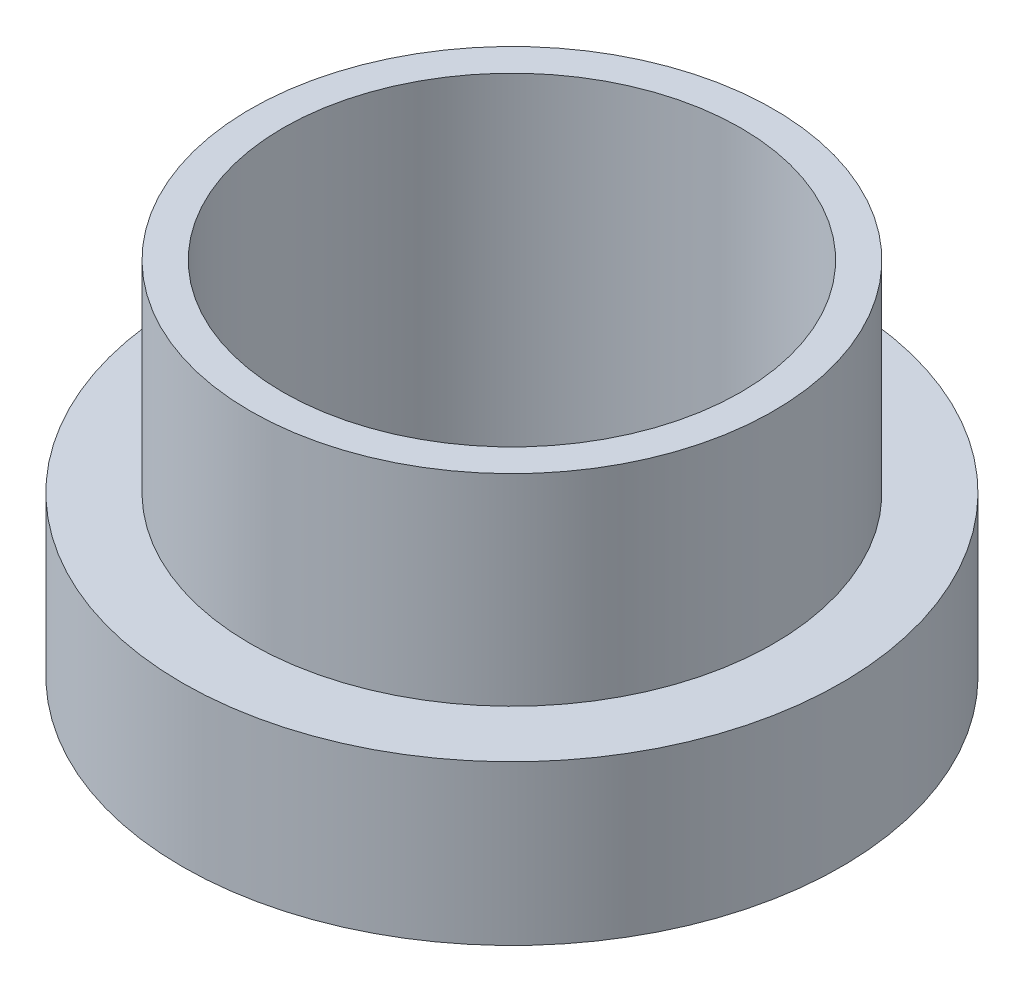
ISO-10303-21;
HEADER;
FILE_DESCRIPTION(('STEP AP214'),'2;1');
FILE_NAME('part.step','',(''),(''),'','','');
FILE_SCHEMA(('AUTOMOTIVE_DESIGN { 1 0 10303 214 1 1 1 1 }'));
ENDSEC;
DATA;
#1=APPLICATION_CONTEXT('core data for automotive mechanical design processes');
#2=APPLICATION_PROTOCOL_DEFINITION('international standard','automotive_design',2000,#1);
#3=PRODUCT_CONTEXT('',#1,'mechanical');
#4=PRODUCT('Part','Part','',(#3));
#5=PRODUCT_RELATED_PRODUCT_CATEGORY('part','',(#4));
#6=PRODUCT_DEFINITION_FORMATION('','',#4);
#7=PRODUCT_DEFINITION_CONTEXT('part definition',#1,'design');
#8=PRODUCT_DEFINITION('design','',#6,#7);
#9=PRODUCT_DEFINITION_SHAPE('','',#8);
#10=(LENGTH_UNIT() NAMED_UNIT(*) SI_UNIT(.MILLI.,.METRE.));
#11=(NAMED_UNIT(*) PLANE_ANGLE_UNIT() SI_UNIT($,.RADIAN.));
#12=(NAMED_UNIT(*) SI_UNIT($,.STERADIAN.) SOLID_ANGLE_UNIT());
#13=UNCERTAINTY_MEASURE_WITH_UNIT(LENGTH_MEASURE(1.E-05),#10,'distance_accuracy_value','');
#14=(GEOMETRIC_REPRESENTATION_CONTEXT(3) GLOBAL_UNCERTAINTY_ASSIGNED_CONTEXT((#13)) GLOBAL_UNIT_ASSIGNED_CONTEXT((#10,
#11,#12)) REPRESENTATION_CONTEXT('',''));
#15=CARTESIAN_POINT('',(0.,0.,0.));
#16=DIRECTION('',(0.,0.,1.));
#17=DIRECTION('',(1.,0.,0.));
#18=AXIS2_PLACEMENT_3D('',#15,#16,#17);
#19=CARTESIAN_POINT('',(4.44089209850063E-13,3.86259999999985,2.22044604925031E-13));
#20=DIRECTION('',(0.,1.,0.));
#21=DIRECTION('',(0.,0.,1.));
#22=AXIS2_PLACEMENT_3D('',#19,#20,#21);
#23=PLANE('',#22);
#24=CARTESIAN_POINT('',(4.44089209850063E-13,3.86259999999985,2.22044604925031E-13));
#25=DIRECTION('',(0.,1.,0.));
#26=DIRECTION('',(0.,0.,1.));
#27=AXIS2_PLACEMENT_3D('',#24,#25,#26);
#28=CIRCLE('',#27,8.);
#29=CARTESIAN_POINT('',(4.54858373188927E-13,3.86259999999986,8.00000000000025));
#30=VERTEX_POINT('',#29);
#31=EDGE_CURVE('E10',#30,#30,#28,.T.);
#32=ORIENTED_EDGE('',*,*,#31,.T.);
#33=EDGE_LOOP('',(#32));
#34=FACE_BOUND('',#33,.T.);
#35=CARTESIAN_POINT('',(4.44089209850063E-13,3.86259999999985,2.22044604925031E-13));
#36=DIRECTION('',(0.,1.,0.));
#37=DIRECTION('',(0.,0.,1.));
#38=AXIS2_PLACEMENT_3D('',#35,#36,#37);
#39=CIRCLE('',#38,6.35);
#40=CARTESIAN_POINT('',(4.52637233250286E-13,3.86259999999986,6.35000000000025));
#41=VERTEX_POINT('',#40);
#42=EDGE_CURVE('E48',#41,#41,#39,.T.);
#43=ORIENTED_EDGE('',*,*,#42,.F.);
#44=EDGE_LOOP('',(#43));
#45=FACE_BOUND('',#44,.T.);
#46=ADVANCED_FACE('F32',(#34,#45),#23,.T.);
#47=CARTESIAN_POINT('',(0.,0.,0.));
#48=DIRECTION('',(0.,1.,0.));
#49=DIRECTION('',(0.,0.,1.));
#50=AXIS2_PLACEMENT_3D('',#47,#48,#49);
#51=PLANE('',#50);
#52=CARTESIAN_POINT('',(0.,0.,0.));
#53=DIRECTION('',(0.,1.,0.));
#54=DIRECTION('',(0.,0.,1.));
#55=AXIS2_PLACEMENT_3D('',#52,#53,#54);
#56=CIRCLE('',#55,8.);
#57=CARTESIAN_POINT('',(0.,0.,8.00000000000003));
#58=VERTEX_POINT('',#57);
#59=EDGE_CURVE('E36',#58,#58,#56,.T.);
#60=ORIENTED_EDGE('',*,*,#59,.F.);
#61=EDGE_LOOP('',(#60));
#62=FACE_BOUND('',#61,.T.);
#63=CARTESIAN_POINT('',(0.,0.,0.));
#64=DIRECTION('',(0.,1.,0.));
#65=DIRECTION('',(0.,0.,1.));
#66=AXIS2_PLACEMENT_3D('',#63,#64,#65);
#67=CIRCLE('',#66,5.55625);
#68=CARTESIAN_POINT('',(0.,0.,5.55625000000002));
#69=VERTEX_POINT('',#68);
#70=EDGE_CURVE('E43',#69,#69,#67,.T.);
#71=ORIENTED_EDGE('',*,*,#70,.T.);
#72=EDGE_LOOP('',(#71));
#73=FACE_BOUND('',#72,.T.);
#74=ADVANCED_FACE('F73',(#62,#73),#51,.F.);
#75=CARTESIAN_POINT('',(4.44089209850063E-13,3.86259999999985,2.22044604925031E-13));
#76=DIRECTION('',(0.,-1.,0.));
#77=DIRECTION('',(0.,0.,-1.));
#78=AXIS2_PLACEMENT_3D('',#75,#76,#77);
#79=CYLINDRICAL_SURFACE('',#78,8.);
#80=ORIENTED_EDGE('',*,*,#31,.F.);
#81=EDGE_LOOP('',(#80));
#82=FACE_BOUND('',#81,.T.);
#83=ORIENTED_EDGE('',*,*,#59,.T.);
#84=EDGE_LOOP('',(#83));
#85=FACE_BOUND('',#84,.T.);
#86=ADVANCED_FACE('F34',(#82,#85),#79,.T.);
#87=CARTESIAN_POINT('',(4.44089209850063E-13,3.86259999999985,2.22044604925031E-13));
#88=DIRECTION('',(0.,-1.,0.));
#89=DIRECTION('',(0.,0.,-1.));
#90=AXIS2_PLACEMENT_3D('',#87,#88,#89);
#91=CYLINDRICAL_SURFACE('',#90,5.55625);
#92=ORIENTED_EDGE('',*,*,#70,.F.);
#93=EDGE_LOOP('',(#92));
#94=FACE_BOUND('',#93,.T.);
#95=CARTESIAN_POINT('',(0.,8.75259999999978,3.33066907387547E-13));
#96=DIRECTION('',(0.,1.,0.));
#97=DIRECTION('',(0.,0.,1.));
#98=AXIS2_PLACEMENT_3D('',#95,#96,#97);
#99=CIRCLE('',#98,5.55625);
#100=CARTESIAN_POINT('',(0.,8.75259999999978,5.55625000000035));
#101=VERTEX_POINT('',#100);
#102=EDGE_CURVE('E51',#101,#101,#99,.T.);
#103=ORIENTED_EDGE('',*,*,#102,.T.);
#104=EDGE_LOOP('',(#103));
#105=FACE_BOUND('',#104,.T.);
#106=ADVANCED_FACE('F57',(#94,#105),#91,.F.);
#107=CARTESIAN_POINT('',(0.,8.75259999999978,3.33066907387547E-13));
#108=DIRECTION('',(0.,1.,0.));
#109=DIRECTION('',(0.,0.,1.));
#110=AXIS2_PLACEMENT_3D('',#107,#108,#109);
#111=PLANE('',#110);
#112=CARTESIAN_POINT('',(0.,8.75259999999978,3.33066907387547E-13));
#113=DIRECTION('',(0.,1.,0.));
#114=DIRECTION('',(0.,0.,1.));
#115=AXIS2_PLACEMENT_3D('',#112,#113,#114);
#116=CIRCLE('',#115,6.35);
#117=CARTESIAN_POINT('',(0.,8.75259999999978,6.35000000000036));
#118=VERTEX_POINT('',#117);
#119=EDGE_CURVE('E47',#118,#118,#116,.T.);
#120=ORIENTED_EDGE('',*,*,#119,.T.);
#121=EDGE_LOOP('',(#120));
#122=FACE_BOUND('',#121,.T.);
#123=ORIENTED_EDGE('',*,*,#102,.F.);
#124=EDGE_LOOP('',(#123));
#125=FACE_BOUND('',#124,.T.);
#126=ADVANCED_FACE('F59',(#122,#125),#111,.T.);
#127=CARTESIAN_POINT('',(0.,8.75259999999978,3.33066907387547E-13));
#128=DIRECTION('',(0.,-1.,0.));
#129=DIRECTION('',(0.,0.,-1.));
#130=AXIS2_PLACEMENT_3D('',#127,#128,#129);
#131=CYLINDRICAL_SURFACE('',#130,6.35);
#132=ORIENTED_EDGE('',*,*,#119,.F.);
#133=EDGE_LOOP('',(#132));
#134=FACE_BOUND('',#133,.T.);
#135=ORIENTED_EDGE('',*,*,#42,.T.);
#136=EDGE_LOOP('',(#135));
#137=FACE_BOUND('',#136,.T.);
#138=ADVANCED_FACE('F61',(#134,#137),#131,.T.);
#139=CLOSED_SHELL('',(#46,#74,#86,#106,#126,#138));
#140=MANIFOLD_SOLID_BREP('B2',#139);
#141=ADVANCED_BREP_SHAPE_REPRESENTATION('',(#18,#140),#14);
#142=SHAPE_DEFINITION_REPRESENTATION(#9,#141);
ENDSEC;
END-ISO-10303-21;
